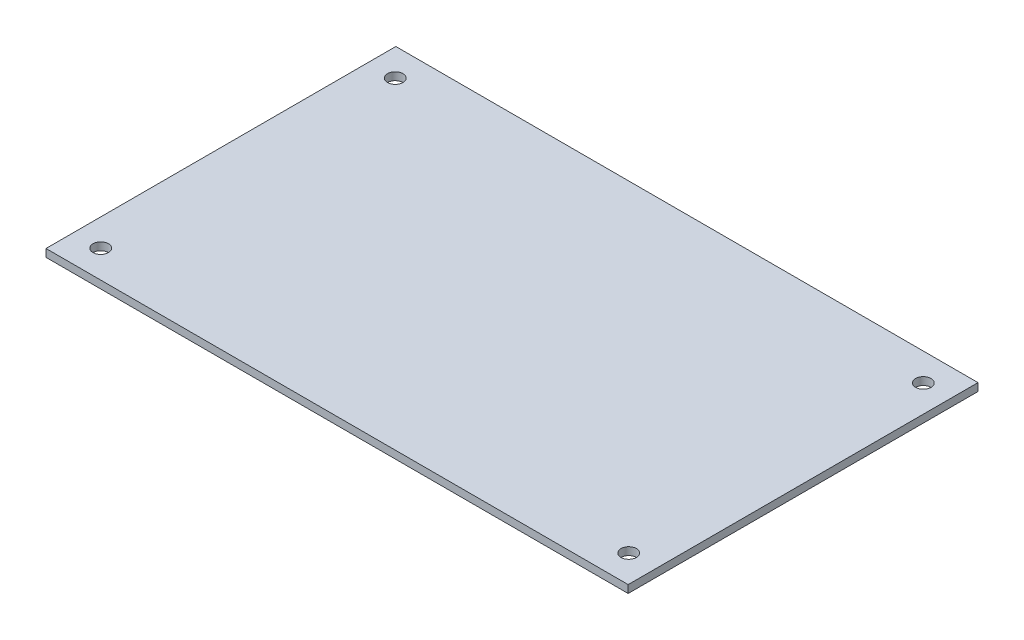
ISO-10303-21;
HEADER;
FILE_DESCRIPTION(('STEP AP214'),'2;1');
FILE_NAME('part.step','',(''),(''),'','','');
FILE_SCHEMA(('AUTOMOTIVE_DESIGN { 1 0 10303 214 1 1 1 1 }'));
ENDSEC;
DATA;
#1=APPLICATION_CONTEXT('core data for automotive mechanical design processes');
#2=APPLICATION_PROTOCOL_DEFINITION('international standard','automotive_design',2000,#1);
#3=PRODUCT_CONTEXT('',#1,'mechanical');
#4=PRODUCT('Part','Part','',(#3));
#5=PRODUCT_RELATED_PRODUCT_CATEGORY('part','',(#4));
#6=PRODUCT_DEFINITION_FORMATION('','',#4);
#7=PRODUCT_DEFINITION_CONTEXT('part definition',#1,'design');
#8=PRODUCT_DEFINITION('design','',#6,#7);
#9=PRODUCT_DEFINITION_SHAPE('','',#8);
#10=(LENGTH_UNIT() NAMED_UNIT(*) SI_UNIT(.MILLI.,.METRE.));
#11=(NAMED_UNIT(*) PLANE_ANGLE_UNIT() SI_UNIT($,.RADIAN.));
#12=(NAMED_UNIT(*) SI_UNIT($,.STERADIAN.) SOLID_ANGLE_UNIT());
#13=UNCERTAINTY_MEASURE_WITH_UNIT(LENGTH_MEASURE(1.E-05),#10,'distance_accuracy_value','');
#14=(GEOMETRIC_REPRESENTATION_CONTEXT(3) GLOBAL_UNCERTAINTY_ASSIGNED_CONTEXT((#13)) GLOBAL_UNIT_ASSIGNED_CONTEXT((#10,
#11,#12)) REPRESENTATION_CONTEXT('',''));
#15=CARTESIAN_POINT('',(0.,0.,0.));
#16=DIRECTION('',(0.,0.,1.));
#17=DIRECTION('',(1.,0.,0.));
#18=AXIS2_PLACEMENT_3D('',#15,#16,#17);
#19=CARTESIAN_POINT('',(0.,2.,0.));
#20=DIRECTION('',(0.,1.,0.));
#21=DIRECTION('',(0.,0.,1.));
#22=AXIS2_PLACEMENT_3D('',#19,#20,#21);
#23=PLANE('',#22);
#24=CARTESIAN_POINT('',(68.3,2.,-38.1));
#25=DIRECTION('',(0.,1.,0.));
#26=DIRECTION('',(0.,0.,1.));
#27=AXIS2_PLACEMENT_3D('',#24,#25,#26);
#28=CIRCLE('',#27,2.);
#29=CARTESIAN_POINT('',(68.3,2.,-36.1));
#30=VERTEX_POINT('',#29);
#31=EDGE_CURVE('E121',#30,#30,#28,.T.);
#32=ORIENTED_EDGE('',*,*,#31,.F.);
#33=EDGE_LOOP('',(#32));
#34=FACE_BOUND('',#33,.T.);
#35=CARTESIAN_POINT('',(-68.3,2.,-38.1));
#36=DIRECTION('',(0.,1.,0.));
#37=DIRECTION('',(0.,0.,1.));
#38=AXIS2_PLACEMENT_3D('',#35,#36,#37);
#39=CIRCLE('',#38,2.);
#40=CARTESIAN_POINT('',(-68.3,2.,-36.1));
#41=VERTEX_POINT('',#40);
#42=EDGE_CURVE('E100',#41,#41,#39,.T.);
#43=ORIENTED_EDGE('',*,*,#42,.F.);
#44=EDGE_LOOP('',(#43));
#45=FACE_BOUND('',#44,.T.);
#46=DIRECTION('',(0.,0.,-1.));
#47=VECTOR('',#46,1.);
#48=CARTESIAN_POINT('',(75.3,2.,-45.25));
#49=LINE('',#48,#47);
#50=CARTESIAN_POINT('',(75.3,2.,45.25));
#51=VERTEX_POINT('',#50);
#52=CARTESIAN_POINT('',(75.3,2.,-45.25));
#53=VERTEX_POINT('',#52);
#54=EDGE_CURVE('E85',#51,#53,#49,.T.);
#55=ORIENTED_EDGE('',*,*,#54,.T.);
#56=DIRECTION('',(-1.,0.,0.));
#57=VECTOR('',#56,1.);
#58=CARTESIAN_POINT('',(-75.3,2.,-45.25));
#59=LINE('',#58,#57);
#60=CARTESIAN_POINT('',(-75.3,2.,-45.25));
#61=VERTEX_POINT('',#60);
#62=EDGE_CURVE('E80',#53,#61,#59,.T.);
#63=ORIENTED_EDGE('',*,*,#62,.T.);
#64=DIRECTION('',(0.,0.,1.));
#65=VECTOR('',#64,1.);
#66=CARTESIAN_POINT('',(-75.3,2.,-45.25));
#67=LINE('',#66,#65);
#68=CARTESIAN_POINT('',(-75.3,2.,45.25));
#69=VERTEX_POINT('',#68);
#70=EDGE_CURVE('E83',#61,#69,#67,.T.);
#71=ORIENTED_EDGE('',*,*,#70,.T.);
#72=DIRECTION('',(1.,0.,0.));
#73=VECTOR('',#72,1.);
#74=CARTESIAN_POINT('',(-75.3,2.,45.25));
#75=LINE('',#74,#73);
#76=EDGE_CURVE('E50',#69,#51,#75,.T.);
#77=ORIENTED_EDGE('',*,*,#76,.T.);
#78=EDGE_LOOP('',(#55,#63,#71,#77));
#79=FACE_BOUND('',#78,.T.);
#80=CARTESIAN_POINT('',(-68.3,2.,38.1));
#81=DIRECTION('',(0.,1.,0.));
#82=DIRECTION('',(0.,0.,1.));
#83=AXIS2_PLACEMENT_3D('',#80,#81,#82);
#84=CIRCLE('',#83,2.);
#85=CARTESIAN_POINT('',(-68.3,2.,40.1));
#86=VERTEX_POINT('',#85);
#87=EDGE_CURVE('E115',#86,#86,#84,.T.);
#88=ORIENTED_EDGE('',*,*,#87,.F.);
#89=EDGE_LOOP('',(#88));
#90=FACE_BOUND('',#89,.T.);
#91=CARTESIAN_POINT('',(68.3,2.,38.1));
#92=DIRECTION('',(0.,1.,0.));
#93=DIRECTION('',(0.,0.,1.));
#94=AXIS2_PLACEMENT_3D('',#91,#92,#93);
#95=CIRCLE('',#94,2.);
#96=CARTESIAN_POINT('',(68.3,2.,40.1));
#97=VERTEX_POINT('',#96);
#98=EDGE_CURVE('E127',#97,#97,#95,.T.);
#99=ORIENTED_EDGE('',*,*,#98,.F.);
#100=EDGE_LOOP('',(#99));
#101=FACE_BOUND('',#100,.T.);
#102=ADVANCED_FACE('F33',(#34,#45,#79,#90,#101),#23,.T.);
#103=CARTESIAN_POINT('',(0.,0.,0.));
#104=DIRECTION('',(0.,1.,0.));
#105=DIRECTION('',(0.,0.,1.));
#106=AXIS2_PLACEMENT_3D('',#103,#104,#105);
#107=PLANE('',#106);
#108=DIRECTION('',(0.,0.,-1.));
#109=VECTOR('',#108,1.);
#110=CARTESIAN_POINT('',(75.3,0.,-45.25));
#111=LINE('',#110,#109);
#112=CARTESIAN_POINT('',(75.3,0.,45.25));
#113=VERTEX_POINT('',#112);
#114=CARTESIAN_POINT('',(75.3,0.,-45.25));
#115=VERTEX_POINT('',#114);
#116=EDGE_CURVE('E97',#113,#115,#111,.T.);
#117=ORIENTED_EDGE('',*,*,#116,.F.);
#118=DIRECTION('',(1.,0.,0.));
#119=VECTOR('',#118,1.);
#120=CARTESIAN_POINT('',(-75.3,0.,45.25));
#121=LINE('',#120,#119);
#122=CARTESIAN_POINT('',(-75.3,0.,45.25));
#123=VERTEX_POINT('',#122);
#124=EDGE_CURVE('E73',#123,#113,#121,.T.);
#125=ORIENTED_EDGE('',*,*,#124,.F.);
#126=DIRECTION('',(0.,0.,1.));
#127=VECTOR('',#126,1.);
#128=CARTESIAN_POINT('',(-75.3,0.,-45.25));
#129=LINE('',#128,#127);
#130=CARTESIAN_POINT('',(-75.3,0.,-45.25));
#131=VERTEX_POINT('',#130);
#132=EDGE_CURVE('E67',#131,#123,#129,.T.);
#133=ORIENTED_EDGE('',*,*,#132,.F.);
#134=DIRECTION('',(-1.,0.,0.));
#135=VECTOR('',#134,1.);
#136=CARTESIAN_POINT('',(-75.3,0.,-45.25));
#137=LINE('',#136,#135);
#138=EDGE_CURVE('E89',#115,#131,#137,.T.);
#139=ORIENTED_EDGE('',*,*,#138,.F.);
#140=EDGE_LOOP('',(#117,#125,#133,#139));
#141=FACE_BOUND('',#140,.T.);
#142=CARTESIAN_POINT('',(-68.3,0.,-38.1));
#143=DIRECTION('',(0.,1.,0.));
#144=DIRECTION('',(0.,0.,1.));
#145=AXIS2_PLACEMENT_3D('',#142,#143,#144);
#146=CIRCLE('',#145,2.);
#147=CARTESIAN_POINT('',(-68.3,0.,-36.1));
#148=VERTEX_POINT('',#147);
#149=EDGE_CURVE('E112',#148,#148,#146,.T.);
#150=ORIENTED_EDGE('',*,*,#149,.T.);
#151=EDGE_LOOP('',(#150));
#152=FACE_BOUND('',#151,.T.);
#153=CARTESIAN_POINT('',(-68.3,0.,38.1));
#154=DIRECTION('',(0.,1.,0.));
#155=DIRECTION('',(0.,0.,1.));
#156=AXIS2_PLACEMENT_3D('',#153,#154,#155);
#157=CIRCLE('',#156,2.);
#158=CARTESIAN_POINT('',(-68.3,0.,40.1));
#159=VERTEX_POINT('',#158);
#160=EDGE_CURVE('E118',#159,#159,#157,.T.);
#161=ORIENTED_EDGE('',*,*,#160,.T.);
#162=EDGE_LOOP('',(#161));
#163=FACE_BOUND('',#162,.T.);
#164=CARTESIAN_POINT('',(68.3,0.,-38.1));
#165=DIRECTION('',(0.,1.,0.));
#166=DIRECTION('',(0.,0.,1.));
#167=AXIS2_PLACEMENT_3D('',#164,#165,#166);
#168=CIRCLE('',#167,2.);
#169=CARTESIAN_POINT('',(68.3,0.,-36.1));
#170=VERTEX_POINT('',#169);
#171=EDGE_CURVE('E124',#170,#170,#168,.T.);
#172=ORIENTED_EDGE('',*,*,#171,.T.);
#173=EDGE_LOOP('',(#172));
#174=FACE_BOUND('',#173,.T.);
#175=CARTESIAN_POINT('',(68.3,0.,38.1));
#176=DIRECTION('',(0.,1.,0.));
#177=DIRECTION('',(0.,0.,1.));
#178=AXIS2_PLACEMENT_3D('',#175,#176,#177);
#179=CIRCLE('',#178,2.);
#180=CARTESIAN_POINT('',(68.3,0.,40.1));
#181=VERTEX_POINT('',#180);
#182=EDGE_CURVE('E130',#181,#181,#179,.T.);
#183=ORIENTED_EDGE('',*,*,#182,.T.);
#184=EDGE_LOOP('',(#183));
#185=FACE_BOUND('',#184,.T.);
#186=ADVANCED_FACE('F108',(#141,#152,#163,#174,#185),#107,.F.);
#187=CARTESIAN_POINT('',(75.3,2.,-45.25));
#188=DIRECTION('',(-1.,0.,0.));
#189=DIRECTION('',(0.,0.,1.));
#190=AXIS2_PLACEMENT_3D('',#187,#188,#189);
#191=PLANE('',#190);
#192=ORIENTED_EDGE('',*,*,#116,.T.);
#193=DIRECTION('',(0.,-1.,0.));
#194=VECTOR('',#193,1.);
#195=CARTESIAN_POINT('',(75.3,2.,-45.25));
#196=LINE('',#195,#194);
#197=EDGE_CURVE('E11',#53,#115,#196,.T.);
#198=ORIENTED_EDGE('',*,*,#197,.F.);
#199=ORIENTED_EDGE('',*,*,#54,.F.);
#200=DIRECTION('',(0.,-1.,0.));
#201=VECTOR('',#200,1.);
#202=CARTESIAN_POINT('',(75.3,2.,45.25));
#203=LINE('',#202,#201);
#204=EDGE_CURVE('E93',#51,#113,#203,.T.);
#205=ORIENTED_EDGE('',*,*,#204,.T.);
#206=EDGE_LOOP('',(#192,#198,#199,#205));
#207=FACE_BOUND('',#206,.T.);
#208=ADVANCED_FACE('F35',(#207),#191,.F.);
#209=CARTESIAN_POINT('',(-75.3,2.,-45.25));
#210=DIRECTION('',(0.,0.,1.));
#211=DIRECTION('',(1.,0.,0.));
#212=AXIS2_PLACEMENT_3D('',#209,#210,#211);
#213=PLANE('',#212);
#214=ORIENTED_EDGE('',*,*,#138,.T.);
#215=DIRECTION('',(0.,-1.,0.));
#216=VECTOR('',#215,1.);
#217=CARTESIAN_POINT('',(-75.3,2.,-45.25));
#218=LINE('',#217,#216);
#219=EDGE_CURVE('E42',#61,#131,#218,.T.);
#220=ORIENTED_EDGE('',*,*,#219,.F.);
#221=ORIENTED_EDGE('',*,*,#62,.F.);
#222=ORIENTED_EDGE('',*,*,#197,.T.);
#223=EDGE_LOOP('',(#214,#220,#221,#222));
#224=FACE_BOUND('',#223,.T.);
#225=ADVANCED_FACE('F88',(#224),#213,.F.);
#226=CARTESIAN_POINT('',(-75.3,2.,-45.25));
#227=DIRECTION('',(1.,0.,0.));
#228=DIRECTION('',(0.,0.,-1.));
#229=AXIS2_PLACEMENT_3D('',#226,#227,#228);
#230=PLANE('',#229);
#231=ORIENTED_EDGE('',*,*,#132,.T.);
#232=DIRECTION('',(0.,-1.,0.));
#233=VECTOR('',#232,1.);
#234=CARTESIAN_POINT('',(-75.3,2.,45.25));
#235=LINE('',#234,#233);
#236=EDGE_CURVE('E90',#69,#123,#235,.T.);
#237=ORIENTED_EDGE('',*,*,#236,.F.);
#238=ORIENTED_EDGE('',*,*,#70,.F.);
#239=ORIENTED_EDGE('',*,*,#219,.T.);
#240=EDGE_LOOP('',(#231,#237,#238,#239));
#241=FACE_BOUND('',#240,.T.);
#242=ADVANCED_FACE('F91',(#241),#230,.F.);
#243=CARTESIAN_POINT('',(-75.3,2.,45.25));
#244=DIRECTION('',(0.,0.,-1.));
#245=DIRECTION('',(-1.,0.,0.));
#246=AXIS2_PLACEMENT_3D('',#243,#244,#245);
#247=PLANE('',#246);
#248=ORIENTED_EDGE('',*,*,#124,.T.);
#249=ORIENTED_EDGE('',*,*,#204,.F.);
#250=ORIENTED_EDGE('',*,*,#76,.F.);
#251=ORIENTED_EDGE('',*,*,#236,.T.);
#252=EDGE_LOOP('',(#248,#249,#250,#251));
#253=FACE_BOUND('',#252,.T.);
#254=ADVANCED_FACE('F105',(#253),#247,.F.);
#255=CARTESIAN_POINT('',(-68.3,2.,-38.1));
#256=DIRECTION('',(0.,-1.,0.));
#257=DIRECTION('',(0.,0.,-1.));
#258=AXIS2_PLACEMENT_3D('',#255,#256,#257);
#259=CYLINDRICAL_SURFACE('',#258,2.);
#260=ORIENTED_EDGE('',*,*,#42,.T.);
#261=EDGE_LOOP('',(#260));
#262=FACE_BOUND('',#261,.T.);
#263=ORIENTED_EDGE('',*,*,#149,.F.);
#264=EDGE_LOOP('',(#263));
#265=FACE_BOUND('',#264,.T.);
#266=ADVANCED_FACE('F149',(#262,#265),#259,.F.);
#267=CARTESIAN_POINT('',(-68.3,2.,38.1));
#268=DIRECTION('',(0.,-1.,0.));
#269=DIRECTION('',(0.,0.,-1.));
#270=AXIS2_PLACEMENT_3D('',#267,#268,#269);
#271=CYLINDRICAL_SURFACE('',#270,2.);
#272=ORIENTED_EDGE('',*,*,#87,.T.);
#273=EDGE_LOOP('',(#272));
#274=FACE_BOUND('',#273,.T.);
#275=ORIENTED_EDGE('',*,*,#160,.F.);
#276=EDGE_LOOP('',(#275));
#277=FACE_BOUND('',#276,.T.);
#278=ADVANCED_FACE('F195',(#274,#277),#271,.F.);
#279=CARTESIAN_POINT('',(68.3,2.,-38.1));
#280=DIRECTION('',(0.,-1.,0.));
#281=DIRECTION('',(0.,0.,-1.));
#282=AXIS2_PLACEMENT_3D('',#279,#280,#281);
#283=CYLINDRICAL_SURFACE('',#282,2.);
#284=ORIENTED_EDGE('',*,*,#31,.T.);
#285=EDGE_LOOP('',(#284));
#286=FACE_BOUND('',#285,.T.);
#287=ORIENTED_EDGE('',*,*,#171,.F.);
#288=EDGE_LOOP('',(#287));
#289=FACE_BOUND('',#288,.T.);
#290=ADVANCED_FACE('F203',(#286,#289),#283,.F.);
#291=CARTESIAN_POINT('',(68.3,2.,38.1));
#292=DIRECTION('',(0.,-1.,0.));
#293=DIRECTION('',(0.,0.,-1.));
#294=AXIS2_PLACEMENT_3D('',#291,#292,#293);
#295=CYLINDRICAL_SURFACE('',#294,2.);
#296=ORIENTED_EDGE('',*,*,#98,.T.);
#297=EDGE_LOOP('',(#296));
#298=FACE_BOUND('',#297,.T.);
#299=ORIENTED_EDGE('',*,*,#182,.F.);
#300=EDGE_LOOP('',(#299));
#301=FACE_BOUND('',#300,.T.);
#302=ADVANCED_FACE('F136',(#298,#301),#295,.F.);
#303=CLOSED_SHELL('',(#102,#186,#208,#225,#242,#254,#266,#278,#290,#302));
#304=MANIFOLD_SOLID_BREP('B2',#303);
#305=ADVANCED_BREP_SHAPE_REPRESENTATION('',(#18,#304),#14);
#306=SHAPE_DEFINITION_REPRESENTATION(#9,#305);
ENDSEC;
END-ISO-10303-21;
